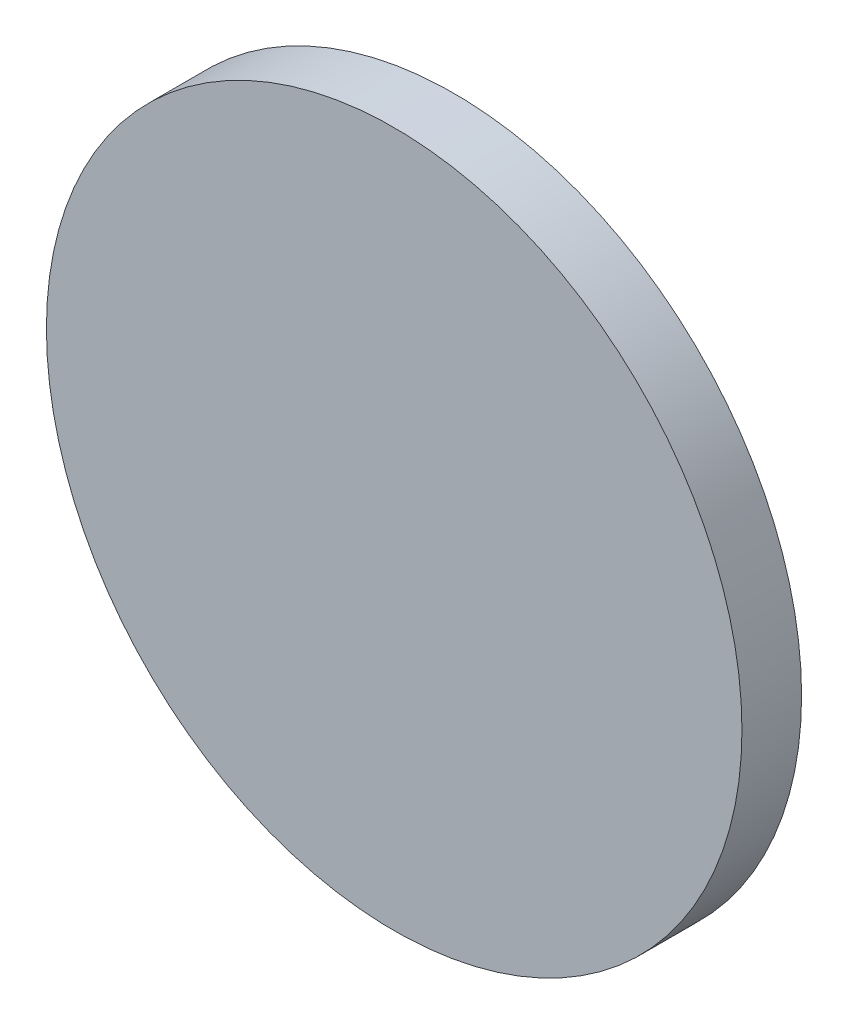
ISO-10303-21;
HEADER;
FILE_DESCRIPTION(('STEP AP214'),'2;1');
FILE_NAME('part.step','',(''),(''),'','','');
FILE_SCHEMA(('AUTOMOTIVE_DESIGN { 1 0 10303 214 1 1 1 1 }'));
ENDSEC;
DATA;
#1=APPLICATION_CONTEXT('core data for automotive mechanical design processes');
#2=APPLICATION_PROTOCOL_DEFINITION('international standard','automotive_design',2000,#1);
#3=PRODUCT_CONTEXT('',#1,'mechanical');
#4=PRODUCT('Part','Part','',(#3));
#5=PRODUCT_RELATED_PRODUCT_CATEGORY('part','',(#4));
#6=PRODUCT_DEFINITION_FORMATION('','',#4);
#7=PRODUCT_DEFINITION_CONTEXT('part definition',#1,'design');
#8=PRODUCT_DEFINITION('design','',#6,#7);
#9=PRODUCT_DEFINITION_SHAPE('','',#8);
#10=(LENGTH_UNIT() NAMED_UNIT(*) SI_UNIT(.MILLI.,.METRE.));
#11=(NAMED_UNIT(*) PLANE_ANGLE_UNIT() SI_UNIT($,.RADIAN.));
#12=(NAMED_UNIT(*) SI_UNIT($,.STERADIAN.) SOLID_ANGLE_UNIT());
#13=UNCERTAINTY_MEASURE_WITH_UNIT(LENGTH_MEASURE(1.E-05),#10,'distance_accuracy_value','');
#14=(GEOMETRIC_REPRESENTATION_CONTEXT(3) GLOBAL_UNCERTAINTY_ASSIGNED_CONTEXT((#13)) GLOBAL_UNIT_ASSIGNED_CONTEXT((#10,
#11,#12)) REPRESENTATION_CONTEXT('',''));
#15=CARTESIAN_POINT('',(0.,0.,0.));
#16=DIRECTION('',(0.,0.,1.));
#17=DIRECTION('',(1.,0.,0.));
#18=AXIS2_PLACEMENT_3D('',#15,#16,#17);
#19=CARTESIAN_POINT('',(10.771,3.661000014875,0.));
#20=DIRECTION('',(0.,0.,-1.));
#21=DIRECTION('',(-1.,0.,0.));
#22=AXIS2_PLACEMENT_3D('',#19,#20,#21);
#23=PLANE('',#22);
#24=CARTESIAN_POINT('',(10.771,3.661000014875,0.));
#25=DIRECTION('',(0.,0.,1.));
#26=DIRECTION('',(1.,0.,0.));
#27=AXIS2_PLACEMENT_3D('',#24,#25,#26);
#28=CIRCLE('',#27,0.200024667);
#29=CARTESIAN_POINT('',(10.971024667,3.661000014875,0.));
#30=VERTEX_POINT('',#29);
#31=EDGE_CURVE('E18',#30,#30,#28,.T.);
#32=ORIENTED_EDGE('',*,*,#31,.F.);
#33=EDGE_LOOP('',(#32));
#34=FACE_BOUND('',#33,.T.);
#35=ADVANCED_FACE('F15',(#34),#23,.T.);
#36=CARTESIAN_POINT('',(10.771,3.661000014875,0.));
#37=DIRECTION('',(0.,0.,1.));
#38=DIRECTION('',(1.,0.,0.));
#39=AXIS2_PLACEMENT_3D('',#36,#37,#38);
#40=CYLINDRICAL_SURFACE('',#39,0.200024667);
#41=CARTESIAN_POINT('',(10.771,3.661000014875,0.03429));
#42=DIRECTION('',(0.,0.,1.));
#43=DIRECTION('',(1.,0.,0.));
#44=AXIS2_PLACEMENT_3D('',#41,#42,#43);
#45=CIRCLE('',#44,0.200024667);
#46=CARTESIAN_POINT('',(10.971024667,3.661000014875,0.03429));
#47=VERTEX_POINT('',#46);
#48=EDGE_CURVE('E10',#47,#47,#45,.T.);
#49=ORIENTED_EDGE('',*,*,#48,.F.);
#50=EDGE_LOOP('',(#49));
#51=FACE_BOUND('',#50,.T.);
#52=ORIENTED_EDGE('',*,*,#31,.T.);
#53=EDGE_LOOP('',(#52));
#54=FACE_BOUND('',#53,.T.);
#55=ADVANCED_FACE('F27',(#51,#54),#40,.T.);
#56=CARTESIAN_POINT('',(10.771,3.661000014875,0.03429));
#57=DIRECTION('',(0.,0.,1.));
#58=DIRECTION('',(1.,0.,0.));
#59=AXIS2_PLACEMENT_3D('',#56,#57,#58);
#60=PLANE('',#59);
#61=ORIENTED_EDGE('',*,*,#48,.T.);
#62=EDGE_LOOP('',(#61));
#63=FACE_BOUND('',#62,.T.);
#64=ADVANCED_FACE('F34',(#63),#60,.T.);
#65=CLOSED_SHELL('',(#35,#55,#64));
#66=MANIFOLD_SOLID_BREP('B1',#65);
#67=ADVANCED_BREP_SHAPE_REPRESENTATION('',(#18,#66),#14);
#68=SHAPE_DEFINITION_REPRESENTATION(#9,#67);
ENDSEC;
END-ISO-10303-21;
